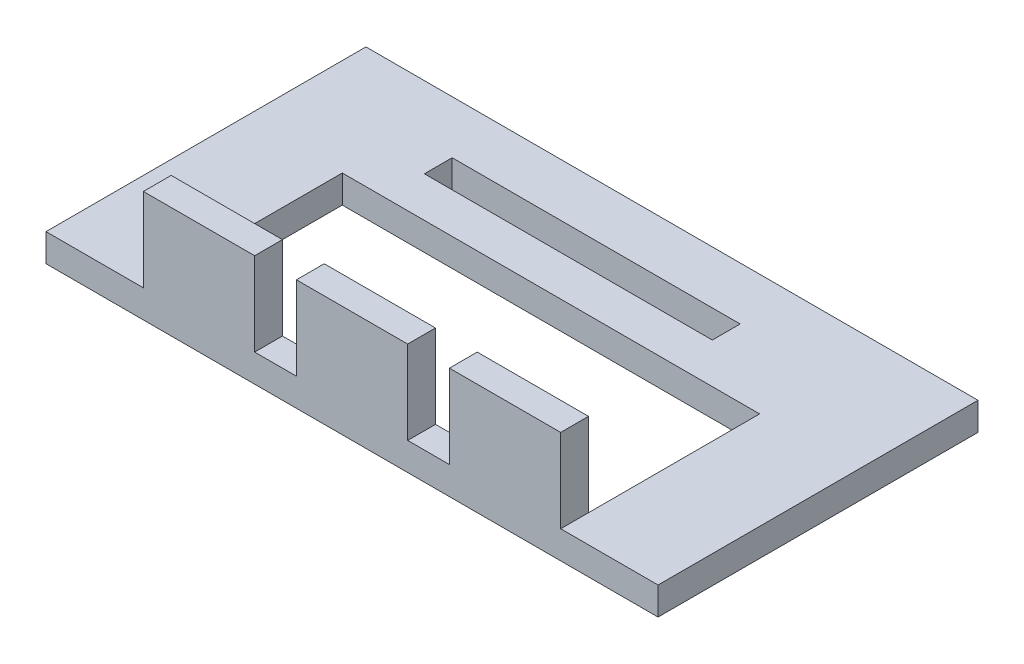
ISO-10303-21;
HEADER;
FILE_DESCRIPTION(('STEP AP214'),'2;1');
FILE_NAME('part.step','',(''),(''),'','','');
FILE_SCHEMA(('AUTOMOTIVE_DESIGN { 1 0 10303 214 1 1 1 1 }'));
ENDSEC;
DATA;
#1=APPLICATION_CONTEXT('core data for automotive mechanical design processes');
#2=APPLICATION_PROTOCOL_DEFINITION('international standard','automotive_design',2000,#1);
#3=PRODUCT_CONTEXT('',#1,'mechanical');
#4=PRODUCT('Part','Part','',(#3));
#5=PRODUCT_RELATED_PRODUCT_CATEGORY('part','',(#4));
#6=PRODUCT_DEFINITION_FORMATION('','',#4);
#7=PRODUCT_DEFINITION_CONTEXT('part definition',#1,'design');
#8=PRODUCT_DEFINITION('design','',#6,#7);
#9=PRODUCT_DEFINITION_SHAPE('','',#8);
#10=(LENGTH_UNIT() NAMED_UNIT(*) SI_UNIT(.MILLI.,.METRE.));
#11=(NAMED_UNIT(*) PLANE_ANGLE_UNIT() SI_UNIT($,.RADIAN.));
#12=(NAMED_UNIT(*) SI_UNIT($,.STERADIAN.) SOLID_ANGLE_UNIT());
#13=UNCERTAINTY_MEASURE_WITH_UNIT(LENGTH_MEASURE(1.E-05),#10,'distance_accuracy_value','');
#14=(GEOMETRIC_REPRESENTATION_CONTEXT(3) GLOBAL_UNCERTAINTY_ASSIGNED_CONTEXT((#13)) GLOBAL_UNIT_ASSIGNED_CONTEXT((#10,
#11,#12)) REPRESENTATION_CONTEXT('',''));
#15=CARTESIAN_POINT('',(0.,0.,0.));
#16=DIRECTION('',(0.,0.,1.));
#17=DIRECTION('',(1.,0.,0.));
#18=AXIS2_PLACEMENT_3D('',#15,#16,#17);
#19=CARTESIAN_POINT('',(0.,2.,0.));
#20=DIRECTION('',(0.,1.,0.));
#21=DIRECTION('',(0.,0.,1.));
#22=AXIS2_PLACEMENT_3D('',#19,#20,#21);
#23=PLANE('',#22);
#24=DIRECTION('',(0.,0.,1.));
#25=VECTOR('',#24,1.);
#26=CARTESIAN_POINT('',(-12.,2.,-5.70000000000001));
#27=LINE('',#26,#25);
#28=CARTESIAN_POINT('',(-12.,2.,-7.70000000000001));
#29=VERTEX_POINT('',#28);
#30=CARTESIAN_POINT('',(-12.,2.,-5.70000000000001));
#31=VERTEX_POINT('',#30);
#32=EDGE_CURVE('E281',#29,#31,#27,.T.);
#33=ORIENTED_EDGE('',*,*,#32,.F.);
#34=DIRECTION('',(-1.,0.,0.));
#35=VECTOR('',#34,1.);
#36=CARTESIAN_POINT('',(-12.,2.,-7.70000000000001));
#37=LINE('',#36,#35);
#38=CARTESIAN_POINT('',(8.7,2.,-7.70000000000001));
#39=VERTEX_POINT('',#38);
#40=EDGE_CURVE('E271',#39,#29,#37,.T.);
#41=ORIENTED_EDGE('',*,*,#40,.F.);
#42=DIRECTION('',(0.,0.,-1.));
#43=VECTOR('',#42,1.);
#44=CARTESIAN_POINT('',(8.7,2.,-5.70000000000001));
#45=LINE('',#44,#43);
#46=CARTESIAN_POINT('',(8.7,2.,-5.70000000000001));
#47=VERTEX_POINT('',#46);
#48=EDGE_CURVE('E287',#47,#39,#45,.T.);
#49=ORIENTED_EDGE('',*,*,#48,.F.);
#50=DIRECTION('',(1.,0.,0.));
#51=VECTOR('',#50,1.);
#52=CARTESIAN_POINT('',(-12.,2.,-5.70000000000001));
#53=LINE('',#52,#51);
#54=EDGE_CURVE('E283',#31,#47,#53,.T.);
#55=ORIENTED_EDGE('',*,*,#54,.F.);
#56=EDGE_LOOP('',(#33,#41,#49,#55));
#57=FACE_BOUND('',#56,.T.);
#58=DIRECTION('',(0.,0.,-1.));
#59=VECTOR('',#58,1.);
#60=CARTESIAN_POINT('',(15.,2.,9.49999999999999));
#61=LINE('',#60,#59);
#62=CARTESIAN_POINT('',(15.,2.,9.49999999999999));
#63=VERTEX_POINT('',#62);
#64=CARTESIAN_POINT('',(15.,2.,-2.80000000000001));
#65=VERTEX_POINT('',#64);
#66=EDGE_CURVE('E266',#63,#65,#61,.T.);
#67=ORIENTED_EDGE('',*,*,#66,.F.);
#68=DIRECTION('',(0.,0.,-1.));
#69=VECTOR('',#68,1.);
#70=CARTESIAN_POINT('',(15.,2.,11.5));
#71=LINE('',#70,#69);
#72=CARTESIAN_POINT('',(15.,2.,11.5));
#73=VERTEX_POINT('',#72);
#74=EDGE_CURVE('E214',#73,#63,#71,.T.);
#75=ORIENTED_EDGE('',*,*,#74,.F.);
#76=DIRECTION('',(1.,0.,0.));
#77=VECTOR('',#76,1.);
#78=CARTESIAN_POINT('',(-22.,2.,11.5));
#79=LINE('',#78,#77);
#80=CARTESIAN_POINT('',(22.,2.,11.5));
#81=VERTEX_POINT('',#80);
#82=EDGE_CURVE('E340',#73,#81,#79,.T.);
#83=ORIENTED_EDGE('',*,*,#82,.T.);
#84=DIRECTION('',(0.,0.,-1.));
#85=VECTOR('',#84,1.);
#86=CARTESIAN_POINT('',(22.,2.,-11.5));
#87=LINE('',#86,#85);
#88=CARTESIAN_POINT('',(22.,2.,-11.5));
#89=VERTEX_POINT('',#88);
#90=EDGE_CURVE('E332',#81,#89,#87,.T.);
#91=ORIENTED_EDGE('',*,*,#90,.T.);
#92=DIRECTION('',(-1.,0.,0.));
#93=VECTOR('',#92,1.);
#94=CARTESIAN_POINT('',(-22.,2.,-11.5));
#95=LINE('',#94,#93);
#96=CARTESIAN_POINT('',(-22.,2.,-11.5));
#97=VERTEX_POINT('',#96);
#98=EDGE_CURVE('E335',#89,#97,#95,.T.);
#99=ORIENTED_EDGE('',*,*,#98,.T.);
#100=DIRECTION('',(0.,0.,1.));
#101=VECTOR('',#100,1.);
#102=CARTESIAN_POINT('',(-22.,2.,-11.5));
#103=LINE('',#102,#101);
#104=CARTESIAN_POINT('',(-22.,2.,11.5));
#105=VERTEX_POINT('',#104);
#106=EDGE_CURVE('E338',#97,#105,#103,.T.);
#107=ORIENTED_EDGE('',*,*,#106,.T.);
#108=CARTESIAN_POINT('',(-15.,2.,11.5));
#109=VERTEX_POINT('',#108);
#110=EDGE_CURVE('E341',#105,#109,#79,.T.);
#111=ORIENTED_EDGE('',*,*,#110,.T.);
#112=DIRECTION('',(0.,0.,1.));
#113=VECTOR('',#112,1.);
#114=CARTESIAN_POINT('',(-15.,2.,11.5));
#115=LINE('',#114,#113);
#116=CARTESIAN_POINT('',(-15.,2.,9.49999999999999));
#117=VERTEX_POINT('',#116);
#118=EDGE_CURVE('E241',#117,#109,#115,.T.);
#119=ORIENTED_EDGE('',*,*,#118,.F.);
#120=DIRECTION('',(0.,0.,1.));
#121=VECTOR('',#120,1.);
#122=CARTESIAN_POINT('',(-15.,2.,9.49999999999999));
#123=LINE('',#122,#121);
#124=CARTESIAN_POINT('',(-15.,2.,-2.80000000000001));
#125=VERTEX_POINT('',#124);
#126=EDGE_CURVE('E319',#125,#117,#123,.T.);
#127=ORIENTED_EDGE('',*,*,#126,.F.);
#128=DIRECTION('',(-1.,0.,0.));
#129=VECTOR('',#128,1.);
#130=CARTESIAN_POINT('',(-15.,2.,-2.80000000000001));
#131=LINE('',#130,#129);
#132=EDGE_CURVE('E316',#65,#125,#131,.T.);
#133=ORIENTED_EDGE('',*,*,#132,.F.);
#134=EDGE_LOOP('',(#67,#75,#83,#91,#99,#107,#111,#119,#127,#133));
#135=FACE_BOUND('',#134,.T.);
#136=ADVANCED_FACE('F33',(#57,#135),#23,.T.);
#137=CARTESIAN_POINT('',(4.00000000000001,2.,11.5));
#138=VERTEX_POINT('',#137);
#139=CARTESIAN_POINT('',(7.00000000000001,2.,11.5));
#140=VERTEX_POINT('',#139);
#141=EDGE_CURVE('E378',#138,#140,#79,.T.);
#142=ORIENTED_EDGE('',*,*,#141,.T.);
#143=DIRECTION('',(0.,0.,1.));
#144=VECTOR('',#143,1.);
#145=CARTESIAN_POINT('',(7.00000000000001,2.,11.5));
#146=LINE('',#145,#144);
#147=CARTESIAN_POINT('',(7.00000000000001,2.,9.49999999999999));
#148=VERTEX_POINT('',#147);
#149=EDGE_CURVE('E210',#148,#140,#146,.T.);
#150=ORIENTED_EDGE('',*,*,#149,.F.);
#151=DIRECTION('',(1.,0.,0.));
#152=VECTOR('',#151,1.);
#153=CARTESIAN_POINT('',(-15.,2.,9.49999999999999));
#154=LINE('',#153,#152);
#155=CARTESIAN_POINT('',(4.00000000000001,2.,9.49999999999999));
#156=VERTEX_POINT('',#155);
#157=EDGE_CURVE('E322',#156,#148,#154,.T.);
#158=ORIENTED_EDGE('',*,*,#157,.F.);
#159=DIRECTION('',(0.,0.,-1.));
#160=VECTOR('',#159,1.);
#161=CARTESIAN_POINT('',(4.00000000000001,2.,11.5));
#162=LINE('',#161,#160);
#163=EDGE_CURVE('E48',#138,#156,#162,.T.);
#164=ORIENTED_EDGE('',*,*,#163,.F.);
#165=EDGE_LOOP('',(#142,#150,#158,#164));
#166=FACE_BOUND('',#165,.T.);
#167=ADVANCED_FACE('F424',(#166),#23,.T.);
#168=CARTESIAN_POINT('',(-6.99999999999999,2.,11.5));
#169=VERTEX_POINT('',#168);
#170=CARTESIAN_POINT('',(-3.99999999999999,2.,11.5));
#171=VERTEX_POINT('',#170);
#172=EDGE_CURVE('E344',#169,#171,#79,.T.);
#173=ORIENTED_EDGE('',*,*,#172,.T.);
#174=DIRECTION('',(0.,0.,1.));
#175=VECTOR('',#174,1.);
#176=CARTESIAN_POINT('',(-3.99999999999999,2.,11.5));
#177=LINE('',#176,#175);
#178=CARTESIAN_POINT('',(-3.99999999999999,2.,9.49999999999999));
#179=VERTEX_POINT('',#178);
#180=EDGE_CURVE('E216',#179,#171,#177,.T.);
#181=ORIENTED_EDGE('',*,*,#180,.F.);
#182=CARTESIAN_POINT('',(-6.99999999999999,2.,9.49999999999999));
#183=VERTEX_POINT('',#182);
#184=EDGE_CURVE('E305',#183,#179,#154,.T.);
#185=ORIENTED_EDGE('',*,*,#184,.F.);
#186=DIRECTION('',(0.,0.,-1.));
#187=VECTOR('',#186,1.);
#188=CARTESIAN_POINT('',(-6.99999999999999,2.,11.5));
#189=LINE('',#188,#187);
#190=EDGE_CURVE('E56',#169,#183,#189,.T.);
#191=ORIENTED_EDGE('',*,*,#190,.F.);
#192=EDGE_LOOP('',(#173,#181,#185,#191));
#193=FACE_BOUND('',#192,.T.);
#194=ADVANCED_FACE('F384',(#193),#23,.T.);
#195=CARTESIAN_POINT('',(22.,2.,-11.5));
#196=DIRECTION('',(-1.,0.,0.));
#197=DIRECTION('',(0.,0.,1.));
#198=AXIS2_PLACEMENT_3D('',#195,#196,#197);
#199=PLANE('',#198);
#200=DIRECTION('',(0.,0.,-1.));
#201=VECTOR('',#200,1.);
#202=CARTESIAN_POINT('',(22.,0.,-11.5));
#203=LINE('',#202,#201);
#204=CARTESIAN_POINT('',(22.,0.,11.5));
#205=VERTEX_POINT('',#204);
#206=CARTESIAN_POINT('',(22.,0.,-11.5));
#207=VERTEX_POINT('',#206);
#208=EDGE_CURVE('E294',#205,#207,#203,.T.);
#209=ORIENTED_EDGE('',*,*,#208,.T.);
#210=DIRECTION('',(0.,-1.,0.));
#211=VECTOR('',#210,1.);
#212=CARTESIAN_POINT('',(22.,2.,-11.5));
#213=LINE('',#212,#211);
#214=EDGE_CURVE('E11',#89,#207,#213,.T.);
#215=ORIENTED_EDGE('',*,*,#214,.F.);
#216=ORIENTED_EDGE('',*,*,#90,.F.);
#217=DIRECTION('',(0.,-1.,0.));
#218=VECTOR('',#217,1.);
#219=CARTESIAN_POINT('',(22.,2.,11.5));
#220=LINE('',#219,#218);
#221=EDGE_CURVE('E343',#81,#205,#220,.T.);
#222=ORIENTED_EDGE('',*,*,#221,.T.);
#223=EDGE_LOOP('',(#209,#215,#216,#222));
#224=FACE_BOUND('',#223,.T.);
#225=ADVANCED_FACE('F35',(#224),#199,.F.);
#226=CARTESIAN_POINT('',(-22.,2.,-11.5));
#227=DIRECTION('',(0.,0.,1.));
#228=DIRECTION('',(1.,0.,0.));
#229=AXIS2_PLACEMENT_3D('',#226,#227,#228);
#230=PLANE('',#229);
#231=DIRECTION('',(-1.,0.,0.));
#232=VECTOR('',#231,1.);
#233=CARTESIAN_POINT('',(-22.,0.,-11.5));
#234=LINE('',#233,#232);
#235=CARTESIAN_POINT('',(-22.,0.,-11.5));
#236=VERTEX_POINT('',#235);
#237=EDGE_CURVE('E347',#207,#236,#234,.T.);
#238=ORIENTED_EDGE('',*,*,#237,.T.);
#239=DIRECTION('',(0.,-1.,0.));
#240=VECTOR('',#239,1.);
#241=CARTESIAN_POINT('',(-22.,2.,-11.5));
#242=LINE('',#241,#240);
#243=EDGE_CURVE('E41',#97,#236,#242,.T.);
#244=ORIENTED_EDGE('',*,*,#243,.F.);
#245=ORIENTED_EDGE('',*,*,#98,.F.);
#246=ORIENTED_EDGE('',*,*,#214,.T.);
#247=EDGE_LOOP('',(#238,#244,#245,#246));
#248=FACE_BOUND('',#247,.T.);
#249=ADVANCED_FACE('F434',(#248),#230,.F.);
#250=CARTESIAN_POINT('',(-22.,2.,-11.5));
#251=DIRECTION('',(1.,0.,0.));
#252=DIRECTION('',(0.,0.,-1.));
#253=AXIS2_PLACEMENT_3D('',#250,#251,#252);
#254=PLANE('',#253);
#255=DIRECTION('',(0.,0.,1.));
#256=VECTOR('',#255,1.);
#257=CARTESIAN_POINT('',(-22.,0.,-11.5));
#258=LINE('',#257,#256);
#259=CARTESIAN_POINT('',(-22.,0.,11.5));
#260=VERTEX_POINT('',#259);
#261=EDGE_CURVE('E349',#236,#260,#258,.T.);
#262=ORIENTED_EDGE('',*,*,#261,.T.);
#263=DIRECTION('',(0.,-1.,0.));
#264=VECTOR('',#263,1.);
#265=CARTESIAN_POINT('',(-22.,2.,11.5));
#266=LINE('',#265,#264);
#267=EDGE_CURVE('E354',#105,#260,#266,.T.);
#268=ORIENTED_EDGE('',*,*,#267,.F.);
#269=ORIENTED_EDGE('',*,*,#106,.F.);
#270=ORIENTED_EDGE('',*,*,#243,.T.);
#271=EDGE_LOOP('',(#262,#268,#269,#270));
#272=FACE_BOUND('',#271,.T.);
#273=ADVANCED_FACE('F361',(#272),#254,.F.);
#274=CARTESIAN_POINT('',(-22.,2.,11.5));
#275=DIRECTION('',(0.,0.,-1.));
#276=DIRECTION('',(-1.,0.,0.));
#277=AXIS2_PLACEMENT_3D('',#274,#275,#276);
#278=PLANE('',#277);
#279=DIRECTION('',(1.,0.,0.));
#280=VECTOR('',#279,1.);
#281=CARTESIAN_POINT('',(-22.,0.,11.5));
#282=LINE('',#281,#280);
#283=EDGE_CURVE('E336',#260,#205,#282,.T.);
#284=ORIENTED_EDGE('',*,*,#283,.T.);
#285=ORIENTED_EDGE('',*,*,#221,.F.);
#286=ORIENTED_EDGE('',*,*,#82,.F.);
#287=DIRECTION('',(0.,-1.,0.));
#288=VECTOR('',#287,1.);
#289=CARTESIAN_POINT('',(15.,8.,11.5));
#290=LINE('',#289,#288);
#291=CARTESIAN_POINT('',(15.,8.,11.5));
#292=VERTEX_POINT('',#291);
#293=EDGE_CURVE('E653',#292,#73,#290,.T.);
#294=ORIENTED_EDGE('',*,*,#293,.F.);
#295=DIRECTION('',(1.,0.,0.));
#296=VECTOR('',#295,1.);
#297=CARTESIAN_POINT('',(7.00000000000001,8.,11.5));
#298=LINE('',#297,#296);
#299=CARTESIAN_POINT('',(7.00000000000001,8.,11.5));
#300=VERTEX_POINT('',#299);
#301=EDGE_CURVE('E207',#300,#292,#298,.T.);
#302=ORIENTED_EDGE('',*,*,#301,.F.);
#303=DIRECTION('',(0.,-1.,0.));
#304=VECTOR('',#303,1.);
#305=CARTESIAN_POINT('',(7.00000000000001,8.,11.5));
#306=LINE('',#305,#304);
#307=EDGE_CURVE('E218',#300,#140,#306,.T.);
#308=ORIENTED_EDGE('',*,*,#307,.T.);
#309=ORIENTED_EDGE('',*,*,#141,.F.);
#310=DIRECTION('',(0.,-1.,0.));
#311=VECTOR('',#310,1.);
#312=CARTESIAN_POINT('',(4.00000000000001,8.,11.5));
#313=LINE('',#312,#311);
#314=CARTESIAN_POINT('',(4.00000000000001,8.,11.5));
#315=VERTEX_POINT('',#314);
#316=EDGE_CURVE('E230',#315,#138,#313,.T.);
#317=ORIENTED_EDGE('',*,*,#316,.F.);
#318=DIRECTION('',(1.,0.,0.));
#319=VECTOR('',#318,1.);
#320=CARTESIAN_POINT('',(-3.99999999999999,8.,11.5));
#321=LINE('',#320,#319);
#322=CARTESIAN_POINT('',(-3.99999999999999,8.,11.5));
#323=VERTEX_POINT('',#322);
#324=EDGE_CURVE('E229',#323,#315,#321,.T.);
#325=ORIENTED_EDGE('',*,*,#324,.F.);
#326=DIRECTION('',(0.,-1.,0.));
#327=VECTOR('',#326,1.);
#328=CARTESIAN_POINT('',(-3.99999999999999,8.,11.5));
#329=LINE('',#328,#327);
#330=EDGE_CURVE('E234',#323,#171,#329,.T.);
#331=ORIENTED_EDGE('',*,*,#330,.T.);
#332=ORIENTED_EDGE('',*,*,#172,.F.);
#333=DIRECTION('',(0.,-1.,0.));
#334=VECTOR('',#333,1.);
#335=CARTESIAN_POINT('',(-6.99999999999999,8.,11.5));
#336=LINE('',#335,#334);
#337=CARTESIAN_POINT('',(-6.99999999999999,8.,11.5));
#338=VERTEX_POINT('',#337);
#339=EDGE_CURVE('E260',#338,#169,#336,.T.);
#340=ORIENTED_EDGE('',*,*,#339,.F.);
#341=DIRECTION('',(1.,0.,0.));
#342=VECTOR('',#341,1.);
#343=CARTESIAN_POINT('',(-15.,8.,11.5));
#344=LINE('',#343,#342);
#345=CARTESIAN_POINT('',(-15.,8.,11.5));
#346=VERTEX_POINT('',#345);
#347=EDGE_CURVE('E245',#346,#338,#344,.T.);
#348=ORIENTED_EDGE('',*,*,#347,.F.);
#349=DIRECTION('',(0.,-1.,0.));
#350=VECTOR('',#349,1.);
#351=CARTESIAN_POINT('',(-15.,8.,11.5));
#352=LINE('',#351,#350);
#353=EDGE_CURVE('E263',#346,#109,#352,.T.);
#354=ORIENTED_EDGE('',*,*,#353,.T.);
#355=ORIENTED_EDGE('',*,*,#110,.F.);
#356=ORIENTED_EDGE('',*,*,#267,.T.);
#357=EDGE_LOOP('',(#284,#285,#286,#294,#302,#308,#309,#317,#325,#331,#332,#340,#348,#354,#355,#356));
#358=FACE_BOUND('',#357,.T.);
#359=ADVANCED_FACE('F370',(#358),#278,.F.);
#360=CARTESIAN_POINT('',(0.,0.,0.));
#361=DIRECTION('',(0.,1.,0.));
#362=DIRECTION('',(0.,0.,1.));
#363=AXIS2_PLACEMENT_3D('',#360,#361,#362);
#364=PLANE('',#363);
#365=DIRECTION('',(-1.,0.,0.));
#366=VECTOR('',#365,1.);
#367=CARTESIAN_POINT('',(-12.,0.,-7.70000000000001));
#368=LINE('',#367,#366);
#369=CARTESIAN_POINT('',(8.7,0.,-7.70000000000001));
#370=VERTEX_POINT('',#369);
#371=CARTESIAN_POINT('',(-12.,0.,-7.70000000000001));
#372=VERTEX_POINT('',#371);
#373=EDGE_CURVE('E277',#370,#372,#368,.T.);
#374=ORIENTED_EDGE('',*,*,#373,.T.);
#375=DIRECTION('',(0.,0.,1.));
#376=VECTOR('',#375,1.);
#377=CARTESIAN_POINT('',(-12.,0.,-5.70000000000001));
#378=LINE('',#377,#376);
#379=CARTESIAN_POINT('',(-12.,0.,-5.70000000000001));
#380=VERTEX_POINT('',#379);
#381=EDGE_CURVE('E267',#372,#380,#378,.T.);
#382=ORIENTED_EDGE('',*,*,#381,.T.);
#383=DIRECTION('',(1.,0.,0.));
#384=VECTOR('',#383,1.);
#385=CARTESIAN_POINT('',(-12.,0.,-5.70000000000001));
#386=LINE('',#385,#384);
#387=CARTESIAN_POINT('',(8.7,0.,-5.70000000000001));
#388=VERTEX_POINT('',#387);
#389=EDGE_CURVE('E270',#380,#388,#386,.T.);
#390=ORIENTED_EDGE('',*,*,#389,.T.);
#391=DIRECTION('',(0.,0.,-1.));
#392=VECTOR('',#391,1.);
#393=CARTESIAN_POINT('',(8.7,0.,-5.70000000000001));
#394=LINE('',#393,#392);
#395=EDGE_CURVE('E274',#388,#370,#394,.T.);
#396=ORIENTED_EDGE('',*,*,#395,.T.);
#397=EDGE_LOOP('',(#374,#382,#390,#396));
#398=FACE_BOUND('',#397,.T.);
#399=DIRECTION('',(1.,0.,0.));
#400=VECTOR('',#399,1.);
#401=CARTESIAN_POINT('',(-15.,0.,9.49999999999999));
#402=LINE('',#401,#400);
#403=CARTESIAN_POINT('',(-15.,0.,9.49999999999999));
#404=VERTEX_POINT('',#403);
#405=CARTESIAN_POINT('',(15.,0.,9.49999999999999));
#406=VERTEX_POINT('',#405);
#407=EDGE_CURVE('E311',#404,#406,#402,.T.);
#408=ORIENTED_EDGE('',*,*,#407,.T.);
#409=DIRECTION('',(0.,0.,-1.));
#410=VECTOR('',#409,1.);
#411=CARTESIAN_POINT('',(15.,0.,9.49999999999999));
#412=LINE('',#411,#410);
#413=CARTESIAN_POINT('',(15.,0.,-2.80000000000001));
#414=VERTEX_POINT('',#413);
#415=EDGE_CURVE('E301',#406,#414,#412,.T.);
#416=ORIENTED_EDGE('',*,*,#415,.T.);
#417=DIRECTION('',(-1.,0.,0.));
#418=VECTOR('',#417,1.);
#419=CARTESIAN_POINT('',(-15.,0.,-2.80000000000001));
#420=LINE('',#419,#418);
#421=CARTESIAN_POINT('',(-15.,0.,-2.80000000000001));
#422=VERTEX_POINT('',#421);
#423=EDGE_CURVE('E304',#414,#422,#420,.T.);
#424=ORIENTED_EDGE('',*,*,#423,.T.);
#425=DIRECTION('',(0.,0.,1.));
#426=VECTOR('',#425,1.);
#427=CARTESIAN_POINT('',(-15.,0.,9.49999999999999));
#428=LINE('',#427,#426);
#429=EDGE_CURVE('E308',#422,#404,#428,.T.);
#430=ORIENTED_EDGE('',*,*,#429,.T.);
#431=EDGE_LOOP('',(#408,#416,#424,#430));
#432=FACE_BOUND('',#431,.T.);
#433=ORIENTED_EDGE('',*,*,#208,.F.);
#434=ORIENTED_EDGE('',*,*,#283,.F.);
#435=ORIENTED_EDGE('',*,*,#261,.F.);
#436=ORIENTED_EDGE('',*,*,#237,.F.);
#437=EDGE_LOOP('',(#433,#434,#435,#436));
#438=FACE_BOUND('',#437,.T.);
#439=ADVANCED_FACE('F367',(#398,#432,#438),#364,.F.);
#440=CARTESIAN_POINT('',(15.,0.,9.49999999999999));
#441=DIRECTION('',(1.,0.,0.));
#442=DIRECTION('',(0.,0.,-1.));
#443=AXIS2_PLACEMENT_3D('',#440,#441,#442);
#444=PLANE('',#443);
#445=ORIENTED_EDGE('',*,*,#66,.T.);
#446=DIRECTION('',(0.,1.,0.));
#447=VECTOR('',#446,1.);
#448=CARTESIAN_POINT('',(15.,0.,-2.80000000000001));
#449=LINE('',#448,#447);
#450=EDGE_CURVE('E314',#414,#65,#449,.T.);
#451=ORIENTED_EDGE('',*,*,#450,.F.);
#452=ORIENTED_EDGE('',*,*,#415,.F.);
#453=DIRECTION('',(0.,1.,0.));
#454=VECTOR('',#453,1.);
#455=CARTESIAN_POINT('',(15.,0.,9.49999999999999));
#456=LINE('',#455,#454);
#457=EDGE_CURVE('E284',#406,#63,#456,.T.);
#458=ORIENTED_EDGE('',*,*,#457,.T.);
#459=EDGE_LOOP('',(#445,#451,#452,#458));
#460=FACE_BOUND('',#459,.T.);
#461=ADVANCED_FACE('F410',(#460),#444,.F.);
#462=CARTESIAN_POINT('',(-15.,0.,9.49999999999999));
#463=DIRECTION('',(0.,0.,1.));
#464=DIRECTION('',(1.,0.,0.));
#465=AXIS2_PLACEMENT_3D('',#462,#463,#464);
#466=PLANE('',#465);
#467=DIRECTION('',(0.,1.,0.));
#468=VECTOR('',#467,1.);
#469=CARTESIAN_POINT('',(-15.,0.,9.49999999999999));
#470=LINE('',#469,#468);
#471=EDGE_CURVE('E326',#404,#117,#470,.T.);
#472=ORIENTED_EDGE('',*,*,#471,.T.);
#473=DIRECTION('',(0.,-1.,0.));
#474=VECTOR('',#473,1.);
#475=CARTESIAN_POINT('',(-15.,8.,9.49999999999999));
#476=LINE('',#475,#474);
#477=CARTESIAN_POINT('',(-15.,8.,9.49999999999999));
#478=VERTEX_POINT('',#477);
#479=EDGE_CURVE('E251',#478,#117,#476,.T.);
#480=ORIENTED_EDGE('',*,*,#479,.F.);
#481=DIRECTION('',(-1.,0.,0.));
#482=VECTOR('',#481,1.);
#483=CARTESIAN_POINT('',(-15.,8.,9.49999999999999));
#484=LINE('',#483,#482);
#485=CARTESIAN_POINT('',(-6.99999999999999,8.,9.49999999999999));
#486=VERTEX_POINT('',#485);
#487=EDGE_CURVE('E249',#486,#478,#484,.T.);
#488=ORIENTED_EDGE('',*,*,#487,.F.);
#489=DIRECTION('',(0.,-1.,0.));
#490=VECTOR('',#489,1.);
#491=CARTESIAN_POINT('',(-6.99999999999999,8.,9.49999999999999));
#492=LINE('',#491,#490);
#493=EDGE_CURVE('E257',#486,#183,#492,.T.);
#494=ORIENTED_EDGE('',*,*,#493,.T.);
#495=ORIENTED_EDGE('',*,*,#184,.T.);
#496=DIRECTION('',(0.,-1.,0.));
#497=VECTOR('',#496,1.);
#498=CARTESIAN_POINT('',(-3.99999999999999,8.,9.49999999999999));
#499=LINE('',#498,#497);
#500=CARTESIAN_POINT('',(-3.99999999999999,8.,9.49999999999999));
#501=VERTEX_POINT('',#500);
#502=EDGE_CURVE('E237',#501,#179,#499,.T.);
#503=ORIENTED_EDGE('',*,*,#502,.F.);
#504=DIRECTION('',(-1.,0.,0.));
#505=VECTOR('',#504,1.);
#506=CARTESIAN_POINT('',(-3.99999999999999,8.,9.49999999999999));
#507=LINE('',#506,#505);
#508=CARTESIAN_POINT('',(4.00000000000001,8.,9.49999999999999));
#509=VERTEX_POINT('',#508);
#510=EDGE_CURVE('E225',#509,#501,#507,.T.);
#511=ORIENTED_EDGE('',*,*,#510,.F.);
#512=DIRECTION('',(0.,-1.,0.));
#513=VECTOR('',#512,1.);
#514=CARTESIAN_POINT('',(4.00000000000001,8.,9.49999999999999));
#515=LINE('',#514,#513);
#516=EDGE_CURVE('E239',#509,#156,#515,.T.);
#517=ORIENTED_EDGE('',*,*,#516,.T.);
#518=ORIENTED_EDGE('',*,*,#157,.T.);
#519=DIRECTION('',(0.,-1.,0.));
#520=VECTOR('',#519,1.);
#521=CARTESIAN_POINT('',(7.00000000000001,8.,9.49999999999999));
#522=LINE('',#521,#520);
#523=CARTESIAN_POINT('',(7.00000000000001,8.,9.49999999999999));
#524=VERTEX_POINT('',#523);
#525=EDGE_CURVE('E198',#524,#148,#522,.T.);
#526=ORIENTED_EDGE('',*,*,#525,.F.);
#527=DIRECTION('',(-1.,0.,0.));
#528=VECTOR('',#527,1.);
#529=CARTESIAN_POINT('',(7.00000000000001,8.,9.49999999999999));
#530=LINE('',#529,#528);
#531=CARTESIAN_POINT('',(15.,8.,9.49999999999999));
#532=VERTEX_POINT('',#531);
#533=EDGE_CURVE('E190',#532,#524,#530,.T.);
#534=ORIENTED_EDGE('',*,*,#533,.F.);
#535=DIRECTION('',(0.,-1.,0.));
#536=VECTOR('',#535,1.);
#537=CARTESIAN_POINT('',(15.,8.,9.49999999999999));
#538=LINE('',#537,#536);
#539=EDGE_CURVE('E195',#532,#63,#538,.T.);
#540=ORIENTED_EDGE('',*,*,#539,.T.);
#541=ORIENTED_EDGE('',*,*,#457,.F.);
#542=ORIENTED_EDGE('',*,*,#407,.F.);
#543=EDGE_LOOP('',(#472,#480,#488,#494,#495,#503,#511,#517,#518,#526,#534,#540,#541,#542));
#544=FACE_BOUND('',#543,.T.);
#545=ADVANCED_FACE('F193',(#544),#466,.F.);
#546=CARTESIAN_POINT('',(-15.,0.,9.49999999999999));
#547=DIRECTION('',(-1.,0.,0.));
#548=DIRECTION('',(0.,0.,1.));
#549=AXIS2_PLACEMENT_3D('',#546,#547,#548);
#550=PLANE('',#549);
#551=ORIENTED_EDGE('',*,*,#126,.T.);
#552=ORIENTED_EDGE('',*,*,#471,.F.);
#553=ORIENTED_EDGE('',*,*,#429,.F.);
#554=DIRECTION('',(0.,1.,0.));
#555=VECTOR('',#554,1.);
#556=CARTESIAN_POINT('',(-15.,0.,-2.80000000000001));
#557=LINE('',#556,#555);
#558=EDGE_CURVE('E328',#422,#125,#557,.T.);
#559=ORIENTED_EDGE('',*,*,#558,.T.);
#560=EDGE_LOOP('',(#551,#552,#553,#559));
#561=FACE_BOUND('',#560,.T.);
#562=ADVANCED_FACE('F404',(#561),#550,.F.);
#563=CARTESIAN_POINT('',(-15.,0.,-2.80000000000001));
#564=DIRECTION('',(0.,0.,-1.));
#565=DIRECTION('',(-1.,0.,0.));
#566=AXIS2_PLACEMENT_3D('',#563,#564,#565);
#567=PLANE('',#566);
#568=ORIENTED_EDGE('',*,*,#132,.T.);
#569=ORIENTED_EDGE('',*,*,#558,.F.);
#570=ORIENTED_EDGE('',*,*,#423,.F.);
#571=ORIENTED_EDGE('',*,*,#450,.T.);
#572=EDGE_LOOP('',(#568,#569,#570,#571));
#573=FACE_BOUND('',#572,.T.);
#574=ADVANCED_FACE('F408',(#573),#567,.F.);
#575=CARTESIAN_POINT('',(-12.,0.,-5.70000000000001));
#576=DIRECTION('',(-1.,0.,0.));
#577=DIRECTION('',(0.,0.,1.));
#578=AXIS2_PLACEMENT_3D('',#575,#576,#577);
#579=PLANE('',#578);
#580=ORIENTED_EDGE('',*,*,#32,.T.);
#581=DIRECTION('',(0.,1.,0.));
#582=VECTOR('',#581,1.);
#583=CARTESIAN_POINT('',(-12.,0.,-5.70000000000001));
#584=LINE('',#583,#582);
#585=EDGE_CURVE('E280',#380,#31,#584,.T.);
#586=ORIENTED_EDGE('',*,*,#585,.F.);
#587=ORIENTED_EDGE('',*,*,#381,.F.);
#588=DIRECTION('',(0.,1.,0.));
#589=VECTOR('',#588,1.);
#590=CARTESIAN_POINT('',(-12.,0.,-7.70000000000001));
#591=LINE('',#590,#589);
#592=EDGE_CURVE('E292',#372,#29,#591,.T.);
#593=ORIENTED_EDGE('',*,*,#592,.T.);
#594=EDGE_LOOP('',(#580,#586,#587,#593));
#595=FACE_BOUND('',#594,.T.);
#596=ADVANCED_FACE('F570',(#595),#579,.F.);
#597=CARTESIAN_POINT('',(-12.,0.,-7.70000000000001));
#598=DIRECTION('',(0.,0.,-1.));
#599=DIRECTION('',(-1.,0.,0.));
#600=AXIS2_PLACEMENT_3D('',#597,#598,#599);
#601=PLANE('',#600);
#602=ORIENTED_EDGE('',*,*,#40,.T.);
#603=ORIENTED_EDGE('',*,*,#592,.F.);
#604=ORIENTED_EDGE('',*,*,#373,.F.);
#605=DIRECTION('',(0.,1.,0.));
#606=VECTOR('',#605,1.);
#607=CARTESIAN_POINT('',(8.7,0.,-7.70000000000001));
#608=LINE('',#607,#606);
#609=EDGE_CURVE('E295',#370,#39,#608,.T.);
#610=ORIENTED_EDGE('',*,*,#609,.T.);
#611=EDGE_LOOP('',(#602,#603,#604,#610));
#612=FACE_BOUND('',#611,.T.);
#613=ADVANCED_FACE('F566',(#612),#601,.F.);
#614=CARTESIAN_POINT('',(8.7,0.,-5.70000000000001));
#615=DIRECTION('',(1.,0.,0.));
#616=DIRECTION('',(0.,0.,-1.));
#617=AXIS2_PLACEMENT_3D('',#614,#615,#616);
#618=PLANE('',#617);
#619=ORIENTED_EDGE('',*,*,#48,.T.);
#620=ORIENTED_EDGE('',*,*,#609,.F.);
#621=ORIENTED_EDGE('',*,*,#395,.F.);
#622=DIRECTION('',(0.,1.,0.));
#623=VECTOR('',#622,1.);
#624=CARTESIAN_POINT('',(8.7,0.,-5.70000000000001));
#625=LINE('',#624,#623);
#626=EDGE_CURVE('E297',#388,#47,#625,.T.);
#627=ORIENTED_EDGE('',*,*,#626,.T.);
#628=EDGE_LOOP('',(#619,#620,#621,#627));
#629=FACE_BOUND('',#628,.T.);
#630=ADVANCED_FACE('F569',(#629),#618,.F.);
#631=CARTESIAN_POINT('',(-12.,0.,-5.70000000000001));
#632=DIRECTION('',(0.,0.,1.));
#633=DIRECTION('',(1.,0.,0.));
#634=AXIS2_PLACEMENT_3D('',#631,#632,#633);
#635=PLANE('',#634);
#636=ORIENTED_EDGE('',*,*,#54,.T.);
#637=ORIENTED_EDGE('',*,*,#626,.F.);
#638=ORIENTED_EDGE('',*,*,#389,.F.);
#639=ORIENTED_EDGE('',*,*,#585,.T.);
#640=EDGE_LOOP('',(#636,#637,#638,#639));
#641=FACE_BOUND('',#640,.T.);
#642=ADVANCED_FACE('F489',(#641),#635,.F.);
#643=CARTESIAN_POINT('',(-15.,8.,11.5));
#644=DIRECTION('',(1.,0.,0.));
#645=DIRECTION('',(0.,0.,-1.));
#646=AXIS2_PLACEMENT_3D('',#643,#644,#645);
#647=PLANE('',#646);
#648=ORIENTED_EDGE('',*,*,#118,.T.);
#649=ORIENTED_EDGE('',*,*,#353,.F.);
#650=DIRECTION('',(0.,0.,1.));
#651=VECTOR('',#650,1.);
#652=CARTESIAN_POINT('',(-15.,8.,11.5));
#653=LINE('',#652,#651);
#654=EDGE_CURVE('E242',#478,#346,#653,.T.);
#655=ORIENTED_EDGE('',*,*,#654,.F.);
#656=ORIENTED_EDGE('',*,*,#479,.T.);
#657=EDGE_LOOP('',(#648,#649,#655,#656));
#658=FACE_BOUND('',#657,.T.);
#659=ADVANCED_FACE('F399',(#658),#647,.F.);
#660=CARTESIAN_POINT('',(-6.99999999999999,8.,11.5));
#661=DIRECTION('',(-1.,0.,0.));
#662=DIRECTION('',(0.,0.,1.));
#663=AXIS2_PLACEMENT_3D('',#660,#661,#662);
#664=PLANE('',#663);
#665=ORIENTED_EDGE('',*,*,#190,.T.);
#666=ORIENTED_EDGE('',*,*,#493,.F.);
#667=DIRECTION('',(0.,0.,-1.));
#668=VECTOR('',#667,1.);
#669=CARTESIAN_POINT('',(-6.99999999999999,8.,11.5));
#670=LINE('',#669,#668);
#671=EDGE_CURVE('E247',#338,#486,#670,.T.);
#672=ORIENTED_EDGE('',*,*,#671,.F.);
#673=ORIENTED_EDGE('',*,*,#339,.T.);
#674=EDGE_LOOP('',(#665,#666,#672,#673));
#675=FACE_BOUND('',#674,.T.);
#676=ADVANCED_FACE('F390',(#675),#664,.F.);
#677=CARTESIAN_POINT('',(0.,8.,0.));
#678=DIRECTION('',(0.,-1.,0.));
#679=DIRECTION('',(0.,0.,-1.));
#680=AXIS2_PLACEMENT_3D('',#677,#678,#679);
#681=PLANE('',#680);
#682=ORIENTED_EDGE('',*,*,#654,.T.);
#683=ORIENTED_EDGE('',*,*,#347,.T.);
#684=ORIENTED_EDGE('',*,*,#671,.T.);
#685=ORIENTED_EDGE('',*,*,#487,.T.);
#686=EDGE_LOOP('',(#682,#683,#684,#685));
#687=FACE_BOUND('',#686,.T.);
#688=ADVANCED_FACE('F394',(#687),#681,.F.);
#689=CARTESIAN_POINT('',(4.00000000000001,8.,11.5));
#690=DIRECTION('',(-1.,0.,0.));
#691=DIRECTION('',(0.,0.,1.));
#692=AXIS2_PLACEMENT_3D('',#689,#690,#691);
#693=PLANE('',#692);
#694=ORIENTED_EDGE('',*,*,#163,.T.);
#695=ORIENTED_EDGE('',*,*,#516,.F.);
#696=DIRECTION('',(0.,0.,-1.));
#697=VECTOR('',#696,1.);
#698=CARTESIAN_POINT('',(4.00000000000001,8.,11.5));
#699=LINE('',#698,#697);
#700=EDGE_CURVE('E222',#315,#509,#699,.T.);
#701=ORIENTED_EDGE('',*,*,#700,.F.);
#702=ORIENTED_EDGE('',*,*,#316,.T.);
#703=EDGE_LOOP('',(#694,#695,#701,#702));
#704=FACE_BOUND('',#703,.T.);
#705=ADVANCED_FACE('F507',(#704),#693,.F.);
#706=CARTESIAN_POINT('',(-3.99999999999999,8.,11.5));
#707=DIRECTION('',(1.,0.,0.));
#708=DIRECTION('',(0.,0.,-1.));
#709=AXIS2_PLACEMENT_3D('',#706,#707,#708);
#710=PLANE('',#709);
#711=ORIENTED_EDGE('',*,*,#180,.T.);
#712=ORIENTED_EDGE('',*,*,#330,.F.);
#713=DIRECTION('',(0.,0.,1.));
#714=VECTOR('',#713,1.);
#715=CARTESIAN_POINT('',(-3.99999999999999,8.,11.5));
#716=LINE('',#715,#714);
#717=EDGE_CURVE('E227',#501,#323,#716,.T.);
#718=ORIENTED_EDGE('',*,*,#717,.F.);
#719=ORIENTED_EDGE('',*,*,#502,.T.);
#720=EDGE_LOOP('',(#711,#712,#718,#719));
#721=FACE_BOUND('',#720,.T.);
#722=ADVANCED_FACE('F516',(#721),#710,.F.);
#723=CARTESIAN_POINT('',(0.,8.,0.));
#724=DIRECTION('',(0.,-1.,0.));
#725=DIRECTION('',(0.,0.,-1.));
#726=AXIS2_PLACEMENT_3D('',#723,#724,#725);
#727=PLANE('',#726);
#728=ORIENTED_EDGE('',*,*,#700,.T.);
#729=ORIENTED_EDGE('',*,*,#510,.T.);
#730=ORIENTED_EDGE('',*,*,#717,.T.);
#731=ORIENTED_EDGE('',*,*,#324,.T.);
#732=EDGE_LOOP('',(#728,#729,#730,#731));
#733=FACE_BOUND('',#732,.T.);
#734=ADVANCED_FACE('F525',(#733),#727,.F.);
#735=CARTESIAN_POINT('',(15.,8.,11.5));
#736=DIRECTION('',(-1.,0.,0.));
#737=DIRECTION('',(0.,0.,1.));
#738=AXIS2_PLACEMENT_3D('',#735,#736,#737);
#739=PLANE('',#738);
#740=ORIENTED_EDGE('',*,*,#74,.T.);
#741=ORIENTED_EDGE('',*,*,#539,.F.);
#742=DIRECTION('',(0.,0.,-1.));
#743=VECTOR('',#742,1.);
#744=CARTESIAN_POINT('',(15.,8.,11.5));
#745=LINE('',#744,#743);
#746=EDGE_CURVE('E202',#292,#532,#745,.T.);
#747=ORIENTED_EDGE('',*,*,#746,.F.);
#748=ORIENTED_EDGE('',*,*,#293,.T.);
#749=EDGE_LOOP('',(#740,#741,#747,#748));
#750=FACE_BOUND('',#749,.T.);
#751=ADVANCED_FACE('F212',(#750),#739,.F.);
#752=CARTESIAN_POINT('',(7.00000000000001,8.,11.5));
#753=DIRECTION('',(1.,0.,0.));
#754=DIRECTION('',(0.,0.,-1.));
#755=AXIS2_PLACEMENT_3D('',#752,#753,#754);
#756=PLANE('',#755);
#757=ORIENTED_EDGE('',*,*,#149,.T.);
#758=ORIENTED_EDGE('',*,*,#307,.F.);
#759=DIRECTION('',(0.,0.,1.));
#760=VECTOR('',#759,1.);
#761=CARTESIAN_POINT('',(7.00000000000001,8.,11.5));
#762=LINE('',#761,#760);
#763=EDGE_CURVE('E201',#524,#300,#762,.T.);
#764=ORIENTED_EDGE('',*,*,#763,.F.);
#765=ORIENTED_EDGE('',*,*,#525,.T.);
#766=EDGE_LOOP('',(#757,#758,#764,#765));
#767=FACE_BOUND('',#766,.T.);
#768=ADVANCED_FACE('F544',(#767),#756,.F.);
#769=CARTESIAN_POINT('',(0.,8.,0.));
#770=DIRECTION('',(0.,-1.,0.));
#771=DIRECTION('',(0.,0.,-1.));
#772=AXIS2_PLACEMENT_3D('',#769,#770,#771);
#773=PLANE('',#772);
#774=ORIENTED_EDGE('',*,*,#746,.T.);
#775=ORIENTED_EDGE('',*,*,#533,.T.);
#776=ORIENTED_EDGE('',*,*,#763,.T.);
#777=ORIENTED_EDGE('',*,*,#301,.T.);
#778=EDGE_LOOP('',(#774,#775,#776,#777));
#779=FACE_BOUND('',#778,.T.);
#780=ADVANCED_FACE('F205',(#779),#773,.F.);
#781=CLOSED_SHELL('',(#136,#167,#194,#225,#249,#273,#359,#439,#461,#545,#562,#574,#596,#613,
#630,#642,#659,#676,#688,#705,#722,#734,#751,#768,#780));
#782=MANIFOLD_SOLID_BREP('B2',#781);
#783=ADVANCED_BREP_SHAPE_REPRESENTATION('',(#18,#782),#14);
#784=SHAPE_DEFINITION_REPRESENTATION(#9,#783);
ENDSEC;
END-ISO-10303-21;
